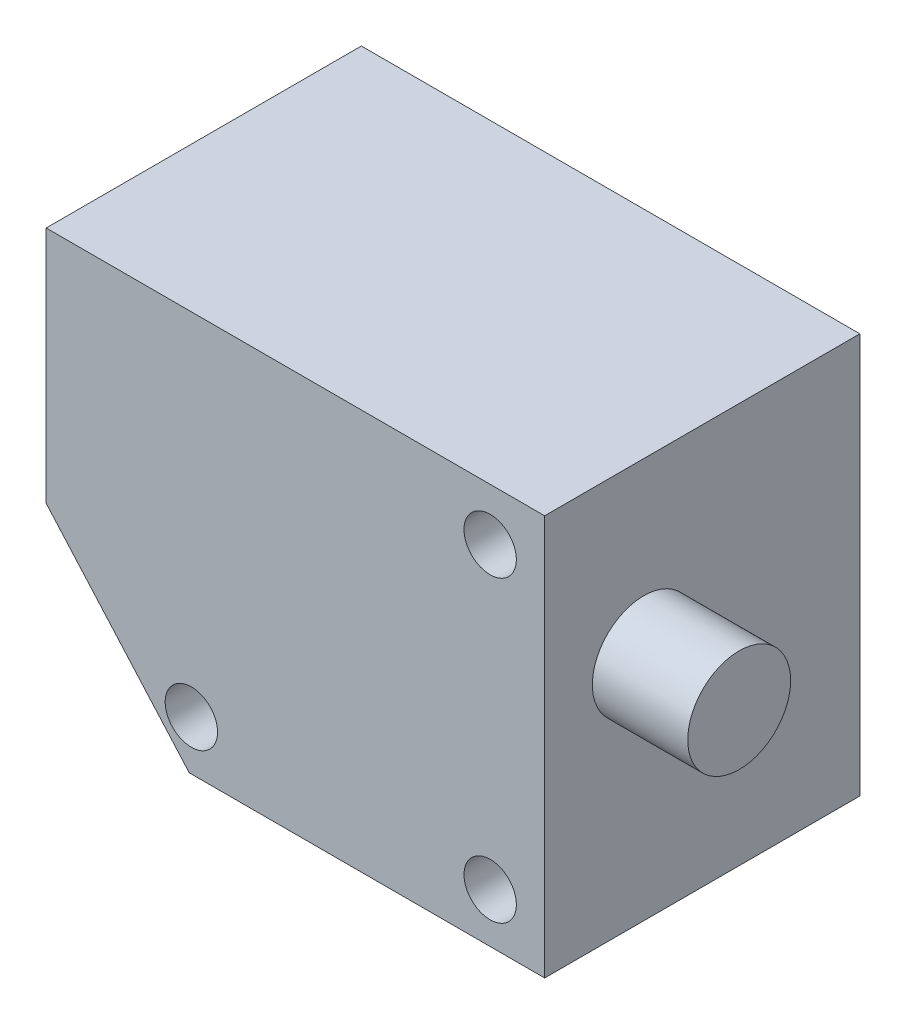
ISO-10303-21;
HEADER;
FILE_DESCRIPTION(('STEP AP214'),'2;1');
FILE_NAME('part.step','',(''),(''),'','','');
FILE_SCHEMA(('AUTOMOTIVE_DESIGN { 1 0 10303 214 1 1 1 1 }'));
ENDSEC;
DATA;
#1=APPLICATION_CONTEXT('core data for automotive mechanical design processes');
#2=APPLICATION_PROTOCOL_DEFINITION('international standard','automotive_design',2000,#1);
#3=PRODUCT_CONTEXT('',#1,'mechanical');
#4=PRODUCT('Part','Part','',(#3));
#5=PRODUCT_RELATED_PRODUCT_CATEGORY('part','',(#4));
#6=PRODUCT_DEFINITION_FORMATION('','',#4);
#7=PRODUCT_DEFINITION_CONTEXT('part definition',#1,'design');
#8=PRODUCT_DEFINITION('design','',#6,#7);
#9=PRODUCT_DEFINITION_SHAPE('','',#8);
#10=(LENGTH_UNIT() NAMED_UNIT(*) SI_UNIT(.MILLI.,.METRE.));
#11=(NAMED_UNIT(*) PLANE_ANGLE_UNIT() SI_UNIT($,.RADIAN.));
#12=(NAMED_UNIT(*) SI_UNIT($,.STERADIAN.) SOLID_ANGLE_UNIT());
#13=UNCERTAINTY_MEASURE_WITH_UNIT(LENGTH_MEASURE(1.E-05),#10,'distance_accuracy_value','');
#14=(GEOMETRIC_REPRESENTATION_CONTEXT(3) GLOBAL_UNCERTAINTY_ASSIGNED_CONTEXT((#13)) GLOBAL_UNIT_ASSIGNED_CONTEXT((#10,
#11,#12)) REPRESENTATION_CONTEXT('',''));
#15=CARTESIAN_POINT('',(0.,0.,0.));
#16=DIRECTION('',(0.,0.,1.));
#17=DIRECTION('',(1.,0.,0.));
#18=AXIS2_PLACEMENT_3D('',#15,#16,#17);
#19=CARTESIAN_POINT('',(26.65,21.4,16.85));
#20=DIRECTION('',(-1.,0.,0.));
#21=DIRECTION('',(0.,0.,1.));
#22=AXIS2_PLACEMENT_3D('',#19,#20,#21);
#23=PLANE('',#22);
#24=CARTESIAN_POINT('',(26.65,3.2,6.25));
#25=DIRECTION('',(1.,0.,0.));
#26=DIRECTION('',(0.,0.,-1.));
#27=AXIS2_PLACEMENT_3D('',#24,#25,#26);
#28=CIRCLE('',#27,5.5);
#29=CARTESIAN_POINT('',(26.65,3.2,0.750000000000001));
#30=VERTEX_POINT('',#29);
#31=EDGE_CURVE('E44',#30,#30,#28,.T.);
#32=ORIENTED_EDGE('',*,*,#31,.F.);
#33=EDGE_LOOP('',(#32));
#34=FACE_BOUND('',#33,.T.);
#35=DIRECTION('',(0.,0.,-1.));
#36=VECTOR('',#35,1.);
#37=CARTESIAN_POINT('',(26.65,-21.4,16.85));
#38=LINE('',#37,#36);
#39=CARTESIAN_POINT('',(26.65,-21.4,16.85));
#40=VERTEX_POINT('',#39);
#41=CARTESIAN_POINT('',(26.65,-21.4,-16.85));
#42=VERTEX_POINT('',#41);
#43=EDGE_CURVE('E98',#40,#42,#38,.T.);
#44=ORIENTED_EDGE('',*,*,#43,.T.);
#45=DIRECTION('',(0.,-1.,0.));
#46=VECTOR('',#45,1.);
#47=CARTESIAN_POINT('',(26.65,21.4,-16.85));
#48=LINE('',#47,#46);
#49=CARTESIAN_POINT('',(26.65,21.4,-16.85));
#50=VERTEX_POINT('',#49);
#51=EDGE_CURVE('E109',#50,#42,#48,.T.);
#52=ORIENTED_EDGE('',*,*,#51,.F.);
#53=DIRECTION('',(0.,0.,-1.));
#54=VECTOR('',#53,1.);
#55=CARTESIAN_POINT('',(26.65,21.4,16.85));
#56=LINE('',#55,#54);
#57=CARTESIAN_POINT('',(26.65,21.4,16.85));
#58=VERTEX_POINT('',#57);
#59=EDGE_CURVE('E117',#58,#50,#56,.T.);
#60=ORIENTED_EDGE('',*,*,#59,.F.);
#61=DIRECTION('',(0.,-1.,0.));
#62=VECTOR('',#61,1.);
#63=CARTESIAN_POINT('',(26.65,21.4,16.85));
#64=LINE('',#63,#62);
#65=EDGE_CURVE('E112',#58,#40,#64,.T.);
#66=ORIENTED_EDGE('',*,*,#65,.T.);
#67=EDGE_LOOP('',(#44,#52,#60,#66));
#68=FACE_BOUND('',#67,.T.);
#69=ADVANCED_FACE('F37',(#34,#68),#23,.F.);
#70=CARTESIAN_POINT('',(-26.65,21.4,-16.85));
#71=DIRECTION('',(0.,0.,1.));
#72=DIRECTION('',(1.,0.,0.));
#73=AXIS2_PLACEMENT_3D('',#70,#71,#72);
#74=PLANE('',#73);
#75=CARTESIAN_POINT('',(20.825,15.825,-16.85));
#76=DIRECTION('',(0.,0.,1.));
#77=DIRECTION('',(1.,0.,0.));
#78=AXIS2_PLACEMENT_3D('',#75,#76,#77);
#79=CIRCLE('',#78,1.44999999999999);
#80=CARTESIAN_POINT('',(22.275,15.825,-16.85));
#81=VERTEX_POINT('',#80);
#82=EDGE_CURVE('E159',#81,#81,#79,.T.);
#83=ORIENTED_EDGE('',*,*,#82,.T.);
#84=EDGE_LOOP('',(#83));
#85=FACE_BOUND('',#84,.T.);
#86=CARTESIAN_POINT('',(20.825,-16.125,-16.85));
#87=DIRECTION('',(0.,0.,1.));
#88=DIRECTION('',(1.,0.,0.));
#89=AXIS2_PLACEMENT_3D('',#86,#87,#88);
#90=CIRCLE('',#89,1.44999999999999);
#91=CARTESIAN_POINT('',(22.275,-16.125,-16.85));
#92=VERTEX_POINT('',#91);
#93=EDGE_CURVE('E147',#92,#92,#90,.T.);
#94=ORIENTED_EDGE('',*,*,#93,.T.);
#95=EDGE_LOOP('',(#94));
#96=FACE_BOUND('',#95,.T.);
#97=CARTESIAN_POINT('',(-11.125,-16.125,-16.85));
#98=DIRECTION('',(0.,0.,1.));
#99=DIRECTION('',(1.,0.,0.));
#100=AXIS2_PLACEMENT_3D('',#97,#98,#99);
#101=CIRCLE('',#100,1.44999999999999);
#102=CARTESIAN_POINT('',(-9.67499999999996,-16.125,-16.85));
#103=VERTEX_POINT('',#102);
#104=EDGE_CURVE('E135',#103,#103,#101,.T.);
#105=ORIENTED_EDGE('',*,*,#104,.T.);
#106=EDGE_LOOP('',(#105));
#107=FACE_BOUND('',#106,.T.);
#108=DIRECTION('',(-1.,0.,0.));
#109=VECTOR('',#108,1.);
#110=CARTESIAN_POINT('',(-26.65,-21.4,-16.85));
#111=LINE('',#110,#109);
#112=CARTESIAN_POINT('',(-11.35,-21.4,-16.85));
#113=VERTEX_POINT('',#112);
#114=EDGE_CURVE('E105',#42,#113,#111,.T.);
#115=ORIENTED_EDGE('',*,*,#114,.T.);
#116=DIRECTION('',(-0.662337662337662,0.749205459836673,0.));
#117=VECTOR('',#116,1.);
#118=CARTESIAN_POINT('',(-26.65,-4.09335387777285,-16.85));
#119=LINE('',#118,#117);
#120=CARTESIAN_POINT('',(-26.65,-4.09335387777285,-16.85));
#121=VERTEX_POINT('',#120);
#122=EDGE_CURVE('E51',#113,#121,#119,.T.);
#123=ORIENTED_EDGE('',*,*,#122,.T.);
#124=DIRECTION('',(0.,-1.,0.));
#125=VECTOR('',#124,1.);
#126=CARTESIAN_POINT('',(-26.65,21.4,-16.85));
#127=LINE('',#126,#125);
#128=CARTESIAN_POINT('',(-26.65,21.4,-16.85));
#129=VERTEX_POINT('',#128);
#130=EDGE_CURVE('E103',#129,#121,#127,.T.);
#131=ORIENTED_EDGE('',*,*,#130,.F.);
#132=DIRECTION('',(-1.,0.,0.));
#133=VECTOR('',#132,1.);
#134=CARTESIAN_POINT('',(-26.65,21.4,-16.85));
#135=LINE('',#134,#133);
#136=EDGE_CURVE('E83',#50,#129,#135,.T.);
#137=ORIENTED_EDGE('',*,*,#136,.F.);
#138=ORIENTED_EDGE('',*,*,#51,.T.);
#139=EDGE_LOOP('',(#115,#123,#131,#137,#138));
#140=FACE_BOUND('',#139,.T.);
#141=ADVANCED_FACE('F102',(#85,#96,#107,#140),#74,.F.);
#142=CARTESIAN_POINT('',(-26.65,21.4,16.85));
#143=DIRECTION('',(1.,0.,0.));
#144=DIRECTION('',(0.,0.,-1.));
#145=AXIS2_PLACEMENT_3D('',#142,#143,#144);
#146=PLANE('',#145);
#147=CARTESIAN_POINT('',(-26.65,3.2,6.25));
#148=DIRECTION('',(1.,0.,0.));
#149=DIRECTION('',(0.,0.,-1.));
#150=AXIS2_PLACEMENT_3D('',#147,#148,#149);
#151=CIRCLE('',#150,5.5);
#152=CARTESIAN_POINT('',(-26.65,3.2,0.750000000000001));
#153=VERTEX_POINT('',#152);
#154=EDGE_CURVE('E11',#153,#153,#151,.F.);
#155=ORIENTED_EDGE('',*,*,#154,.F.);
#156=EDGE_LOOP('',(#155));
#157=FACE_BOUND('',#156,.T.);
#158=ORIENTED_EDGE('',*,*,#130,.T.);
#159=DIRECTION('',(0.,0.,1.));
#160=VECTOR('',#159,1.);
#161=CARTESIAN_POINT('',(-26.65,-4.09335387777285,-16.85));
#162=LINE('',#161,#160);
#163=CARTESIAN_POINT('',(-26.65,-4.09335387777285,16.85));
#164=VERTEX_POINT('',#163);
#165=EDGE_CURVE('E91',#121,#164,#162,.T.);
#166=ORIENTED_EDGE('',*,*,#165,.T.);
#167=DIRECTION('',(0.,-1.,0.));
#168=VECTOR('',#167,1.);
#169=CARTESIAN_POINT('',(-26.65,21.4,16.85));
#170=LINE('',#169,#168);
#171=CARTESIAN_POINT('',(-26.65,21.4,16.85));
#172=VERTEX_POINT('',#171);
#173=EDGE_CURVE('E110',#172,#164,#170,.T.);
#174=ORIENTED_EDGE('',*,*,#173,.F.);
#175=DIRECTION('',(0.,0.,1.));
#176=VECTOR('',#175,1.);
#177=CARTESIAN_POINT('',(-26.65,21.4,16.85));
#178=LINE('',#177,#176);
#179=EDGE_CURVE('E108',#129,#172,#178,.T.);
#180=ORIENTED_EDGE('',*,*,#179,.F.);
#181=EDGE_LOOP('',(#158,#166,#174,#180));
#182=FACE_BOUND('',#181,.T.);
#183=ADVANCED_FACE('F107',(#157,#182),#146,.F.);
#184=CARTESIAN_POINT('',(-26.65,21.4,16.85));
#185=DIRECTION('',(0.,0.,-1.));
#186=DIRECTION('',(-1.,0.,0.));
#187=AXIS2_PLACEMENT_3D('',#184,#185,#186);
#188=PLANE('',#187);
#189=CARTESIAN_POINT('',(20.825,15.825,16.85));
#190=DIRECTION('',(0.,0.,1.));
#191=DIRECTION('',(1.,0.,0.));
#192=AXIS2_PLACEMENT_3D('',#189,#190,#191);
#193=CIRCLE('',#192,2.8);
#194=CARTESIAN_POINT('',(23.625,15.825,16.85));
#195=VERTEX_POINT('',#194);
#196=EDGE_CURVE('E168',#195,#195,#193,.T.);
#197=ORIENTED_EDGE('',*,*,#196,.F.);
#198=EDGE_LOOP('',(#197));
#199=FACE_BOUND('',#198,.T.);
#200=CARTESIAN_POINT('',(20.825,-16.125,16.85));
#201=DIRECTION('',(0.,0.,1.));
#202=DIRECTION('',(1.,0.,0.));
#203=AXIS2_PLACEMENT_3D('',#200,#201,#202);
#204=CIRCLE('',#203,2.8);
#205=CARTESIAN_POINT('',(23.625,-16.125,16.85));
#206=VERTEX_POINT('',#205);
#207=EDGE_CURVE('E156',#206,#206,#204,.T.);
#208=ORIENTED_EDGE('',*,*,#207,.F.);
#209=EDGE_LOOP('',(#208));
#210=FACE_BOUND('',#209,.T.);
#211=CARTESIAN_POINT('',(-11.125,-16.125,16.85));
#212=DIRECTION('',(0.,0.,1.));
#213=DIRECTION('',(1.,0.,0.));
#214=AXIS2_PLACEMENT_3D('',#211,#212,#213);
#215=CIRCLE('',#214,2.8);
#216=CARTESIAN_POINT('',(-8.32499999999995,-16.125,16.85));
#217=VERTEX_POINT('',#216);
#218=EDGE_CURVE('E144',#217,#217,#215,.T.);
#219=ORIENTED_EDGE('',*,*,#218,.F.);
#220=EDGE_LOOP('',(#219));
#221=FACE_BOUND('',#220,.T.);
#222=ORIENTED_EDGE('',*,*,#173,.T.);
#223=DIRECTION('',(-0.662337662337662,0.749205459836673,0.));
#224=VECTOR('',#223,1.);
#225=CARTESIAN_POINT('',(-26.65,-4.09335387777285,16.85));
#226=LINE('',#225,#224);
#227=CARTESIAN_POINT('',(-11.35,-21.4,16.85));
#228=VERTEX_POINT('',#227);
#229=EDGE_CURVE('E93',#228,#164,#226,.T.);
#230=ORIENTED_EDGE('',*,*,#229,.F.);
#231=DIRECTION('',(1.,0.,0.));
#232=VECTOR('',#231,1.);
#233=CARTESIAN_POINT('',(-26.65,-21.4,16.85));
#234=LINE('',#233,#232);
#235=EDGE_CURVE('E75',#228,#40,#234,.T.);
#236=ORIENTED_EDGE('',*,*,#235,.T.);
#237=ORIENTED_EDGE('',*,*,#65,.F.);
#238=DIRECTION('',(1.,0.,0.));
#239=VECTOR('',#238,1.);
#240=CARTESIAN_POINT('',(-26.65,21.4,16.85));
#241=LINE('',#240,#239);
#242=EDGE_CURVE('E60',#172,#58,#241,.T.);
#243=ORIENTED_EDGE('',*,*,#242,.F.);
#244=EDGE_LOOP('',(#222,#230,#236,#237,#243));
#245=FACE_BOUND('',#244,.T.);
#246=ADVANCED_FACE('F174',(#199,#210,#221,#245),#188,.F.);
#247=CARTESIAN_POINT('',(0.,21.4,0.));
#248=DIRECTION('',(0.,-1.,0.));
#249=DIRECTION('',(0.,0.,-1.));
#250=AXIS2_PLACEMENT_3D('',#247,#248,#249);
#251=PLANE('',#250);
#252=ORIENTED_EDGE('',*,*,#59,.T.);
#253=ORIENTED_EDGE('',*,*,#136,.T.);
#254=ORIENTED_EDGE('',*,*,#179,.T.);
#255=ORIENTED_EDGE('',*,*,#242,.T.);
#256=EDGE_LOOP('',(#252,#253,#254,#255));
#257=FACE_BOUND('',#256,.T.);
#258=ADVANCED_FACE('F177',(#257),#251,.F.);
#259=CARTESIAN_POINT('',(0.,-21.4,0.));
#260=DIRECTION('',(0.,-1.,0.));
#261=DIRECTION('',(0.,0.,-1.));
#262=AXIS2_PLACEMENT_3D('',#259,#260,#261);
#263=PLANE('',#262);
#264=DIRECTION('',(0.,0.,1.));
#265=VECTOR('',#264,1.);
#266=CARTESIAN_POINT('',(-11.35,-21.4,-16.85));
#267=LINE('',#266,#265);
#268=EDGE_CURVE('E99',#113,#228,#267,.T.);
#269=ORIENTED_EDGE('',*,*,#268,.F.);
#270=ORIENTED_EDGE('',*,*,#114,.F.);
#271=ORIENTED_EDGE('',*,*,#43,.F.);
#272=ORIENTED_EDGE('',*,*,#235,.F.);
#273=EDGE_LOOP('',(#269,#270,#271,#272));
#274=FACE_BOUND('',#273,.T.);
#275=ADVANCED_FACE('F187',(#274),#263,.T.);
#276=CARTESIAN_POINT('',(-26.65,-4.09335387777285,-16.85));
#277=DIRECTION('',(0.749205459836673,0.662337662337662,0.));
#278=DIRECTION('',(-0.662337662337662,0.749205459836673,0.));
#279=AXIS2_PLACEMENT_3D('',#276,#277,#278);
#280=PLANE('',#279);
#281=ORIENTED_EDGE('',*,*,#229,.T.);
#282=ORIENTED_EDGE('',*,*,#165,.F.);
#283=ORIENTED_EDGE('',*,*,#122,.F.);
#284=ORIENTED_EDGE('',*,*,#268,.T.);
#285=EDGE_LOOP('',(#281,#282,#283,#284));
#286=FACE_BOUND('',#285,.T.);
#287=ADVANCED_FACE('F92',(#286),#280,.F.);
#288=CARTESIAN_POINT('',(36.85,3.2,6.25));
#289=DIRECTION('',(-1.,0.,0.));
#290=DIRECTION('',(0.,0.,1.));
#291=AXIS2_PLACEMENT_3D('',#288,#289,#290);
#292=CYLINDRICAL_SURFACE('',#291,5.5);
#293=CARTESIAN_POINT('',(36.85,3.2,6.25));
#294=DIRECTION('',(1.,0.,0.));
#295=DIRECTION('',(0.,0.,-1.));
#296=AXIS2_PLACEMENT_3D('',#293,#294,#295);
#297=CIRCLE('',#296,5.5);
#298=CARTESIAN_POINT('',(36.85,3.2,0.750000000000001));
#299=VERTEX_POINT('',#298);
#300=EDGE_CURVE('E126',#299,#299,#297,.T.);
#301=ORIENTED_EDGE('',*,*,#300,.F.);
#302=EDGE_LOOP('',(#301));
#303=FACE_BOUND('',#302,.T.);
#304=ORIENTED_EDGE('',*,*,#31,.T.);
#305=EDGE_LOOP('',(#304));
#306=FACE_BOUND('',#305,.T.);
#307=ADVANCED_FACE('F203',(#303,#306),#292,.T.);
#308=CARTESIAN_POINT('',(36.85,3.2,6.25));
#309=DIRECTION('',(1.,0.,0.));
#310=DIRECTION('',(0.,0.,-1.));
#311=AXIS2_PLACEMENT_3D('',#308,#309,#310);
#312=PLANE('',#311);
#313=ORIENTED_EDGE('',*,*,#300,.T.);
#314=EDGE_LOOP('',(#313));
#315=FACE_BOUND('',#314,.T.);
#316=ADVANCED_FACE('F205',(#315),#312,.T.);
#317=CARTESIAN_POINT('',(-30.65,3.2,6.25));
#318=DIRECTION('',(1.,0.,0.));
#319=DIRECTION('',(0.,0.,-1.));
#320=AXIS2_PLACEMENT_3D('',#317,#318,#319);
#321=CYLINDRICAL_SURFACE('',#320,5.5);
#322=CARTESIAN_POINT('',(-30.65,3.2,6.25));
#323=DIRECTION('',(-1.,0.,0.));
#324=DIRECTION('',(0.,0.,1.));
#325=AXIS2_PLACEMENT_3D('',#322,#323,#324);
#326=CIRCLE('',#325,5.5);
#327=CARTESIAN_POINT('',(-30.65,3.2,11.75));
#328=VERTEX_POINT('',#327);
#329=EDGE_CURVE('E132',#328,#328,#326,.T.);
#330=ORIENTED_EDGE('',*,*,#329,.F.);
#331=EDGE_LOOP('',(#330));
#332=FACE_BOUND('',#331,.T.);
#333=ORIENTED_EDGE('',*,*,#154,.T.);
#334=EDGE_LOOP('',(#333));
#335=FACE_BOUND('',#334,.T.);
#336=ADVANCED_FACE('F212',(#332,#335),#321,.T.);
#337=CARTESIAN_POINT('',(-30.65,3.2,6.25));
#338=DIRECTION('',(-1.,0.,0.));
#339=DIRECTION('',(0.,0.,1.));
#340=AXIS2_PLACEMENT_3D('',#337,#338,#339);
#341=PLANE('',#340);
#342=ORIENTED_EDGE('',*,*,#329,.T.);
#343=EDGE_LOOP('',(#342));
#344=FACE_BOUND('',#343,.T.);
#345=ADVANCED_FACE('F219',(#344),#341,.T.);
#346=CARTESIAN_POINT('',(-11.125,-16.125,16.85));
#347=DIRECTION('',(0.,0.,1.));
#348=DIRECTION('',(1.,0.,0.));
#349=AXIS2_PLACEMENT_3D('',#346,#347,#348);
#350=CYLINDRICAL_SURFACE('',#349,1.45);
#351=ORIENTED_EDGE('',*,*,#104,.F.);
#352=EDGE_LOOP('',(#351));
#353=FACE_BOUND('',#352,.T.);
#354=CARTESIAN_POINT('',(-11.125,-16.125,12.46));
#355=DIRECTION('',(0.,0.,1.));
#356=DIRECTION('',(1.,0.,0.));
#357=AXIS2_PLACEMENT_3D('',#354,#355,#356);
#358=CIRCLE('',#357,1.45);
#359=CARTESIAN_POINT('',(-9.67499999999995,-16.125,12.46));
#360=VERTEX_POINT('',#359);
#361=EDGE_CURVE('E138',#360,#360,#358,.T.);
#362=ORIENTED_EDGE('',*,*,#361,.T.);
#363=EDGE_LOOP('',(#362));
#364=FACE_BOUND('',#363,.T.);
#365=ADVANCED_FACE('F223',(#353,#364),#350,.F.);
#366=CARTESIAN_POINT('',(-9.67499999999995,-16.125,12.46));
#367=DIRECTION('',(0.,0.,-1.));
#368=DIRECTION('',(-1.,0.,0.));
#369=AXIS2_PLACEMENT_3D('',#366,#367,#368);
#370=PLANE('',#369);
#371=ORIENTED_EDGE('',*,*,#361,.F.);
#372=EDGE_LOOP('',(#371));
#373=FACE_BOUND('',#372,.T.);
#374=CARTESIAN_POINT('',(-11.125,-16.125,12.46));
#375=DIRECTION('',(0.,0.,1.));
#376=DIRECTION('',(1.,0.,0.));
#377=AXIS2_PLACEMENT_3D('',#374,#375,#376);
#378=CIRCLE('',#377,2.8);
#379=CARTESIAN_POINT('',(-8.32499999999995,-16.125,12.46));
#380=VERTEX_POINT('',#379);
#381=EDGE_CURVE('E141',#380,#380,#378,.T.);
#382=ORIENTED_EDGE('',*,*,#381,.T.);
#383=EDGE_LOOP('',(#382));
#384=FACE_BOUND('',#383,.T.);
#385=ADVANCED_FACE('F227',(#373,#384),#370,.F.);
#386=CARTESIAN_POINT('',(-11.125,-16.125,16.85));
#387=DIRECTION('',(0.,0.,1.));
#388=DIRECTION('',(1.,0.,0.));
#389=AXIS2_PLACEMENT_3D('',#386,#387,#388);
#390=CYLINDRICAL_SURFACE('',#389,2.8);
#391=ORIENTED_EDGE('',*,*,#381,.F.);
#392=EDGE_LOOP('',(#391));
#393=FACE_BOUND('',#392,.T.);
#394=ORIENTED_EDGE('',*,*,#218,.T.);
#395=EDGE_LOOP('',(#394));
#396=FACE_BOUND('',#395,.T.);
#397=ADVANCED_FACE('F231',(#393,#396),#390,.F.);
#398=CARTESIAN_POINT('',(20.825,-16.125,16.85));
#399=DIRECTION('',(0.,0.,1.));
#400=DIRECTION('',(1.,0.,0.));
#401=AXIS2_PLACEMENT_3D('',#398,#399,#400);
#402=CYLINDRICAL_SURFACE('',#401,1.45);
#403=ORIENTED_EDGE('',*,*,#93,.F.);
#404=EDGE_LOOP('',(#403));
#405=FACE_BOUND('',#404,.T.);
#406=CARTESIAN_POINT('',(20.825,-16.125,12.46));
#407=DIRECTION('',(0.,0.,1.));
#408=DIRECTION('',(1.,0.,0.));
#409=AXIS2_PLACEMENT_3D('',#406,#407,#408);
#410=CIRCLE('',#409,1.45);
#411=CARTESIAN_POINT('',(22.2750000000001,-16.125,12.46));
#412=VERTEX_POINT('',#411);
#413=EDGE_CURVE('E150',#412,#412,#410,.T.);
#414=ORIENTED_EDGE('',*,*,#413,.T.);
#415=EDGE_LOOP('',(#414));
#416=FACE_BOUND('',#415,.T.);
#417=ADVANCED_FACE('F235',(#405,#416),#402,.F.);
#418=CARTESIAN_POINT('',(22.2750000000001,-16.125,12.46));
#419=DIRECTION('',(0.,0.,-1.));
#420=DIRECTION('',(-1.,0.,0.));
#421=AXIS2_PLACEMENT_3D('',#418,#419,#420);
#422=PLANE('',#421);
#423=ORIENTED_EDGE('',*,*,#413,.F.);
#424=EDGE_LOOP('',(#423));
#425=FACE_BOUND('',#424,.T.);
#426=CARTESIAN_POINT('',(20.825,-16.125,12.46));
#427=DIRECTION('',(0.,0.,1.));
#428=DIRECTION('',(1.,0.,0.));
#429=AXIS2_PLACEMENT_3D('',#426,#427,#428);
#430=CIRCLE('',#429,2.8);
#431=CARTESIAN_POINT('',(23.625,-16.125,12.46));
#432=VERTEX_POINT('',#431);
#433=EDGE_CURVE('E153',#432,#432,#430,.T.);
#434=ORIENTED_EDGE('',*,*,#433,.T.);
#435=EDGE_LOOP('',(#434));
#436=FACE_BOUND('',#435,.T.);
#437=ADVANCED_FACE('F239',(#425,#436),#422,.F.);
#438=CARTESIAN_POINT('',(20.825,-16.125,16.85));
#439=DIRECTION('',(0.,0.,1.));
#440=DIRECTION('',(1.,0.,0.));
#441=AXIS2_PLACEMENT_3D('',#438,#439,#440);
#442=CYLINDRICAL_SURFACE('',#441,2.8);
#443=ORIENTED_EDGE('',*,*,#433,.F.);
#444=EDGE_LOOP('',(#443));
#445=FACE_BOUND('',#444,.T.);
#446=ORIENTED_EDGE('',*,*,#207,.T.);
#447=EDGE_LOOP('',(#446));
#448=FACE_BOUND('',#447,.T.);
#449=ADVANCED_FACE('F243',(#445,#448),#442,.F.);
#450=CARTESIAN_POINT('',(20.825,15.825,16.85));
#451=DIRECTION('',(0.,0.,1.));
#452=DIRECTION('',(1.,0.,0.));
#453=AXIS2_PLACEMENT_3D('',#450,#451,#452);
#454=CYLINDRICAL_SURFACE('',#453,1.45);
#455=ORIENTED_EDGE('',*,*,#82,.F.);
#456=EDGE_LOOP('',(#455));
#457=FACE_BOUND('',#456,.T.);
#458=CARTESIAN_POINT('',(20.825,15.825,12.46));
#459=DIRECTION('',(0.,0.,1.));
#460=DIRECTION('',(1.,0.,0.));
#461=AXIS2_PLACEMENT_3D('',#458,#459,#460);
#462=CIRCLE('',#461,1.45);
#463=CARTESIAN_POINT('',(22.2750000000001,15.825,12.46));
#464=VERTEX_POINT('',#463);
#465=EDGE_CURVE('E162',#464,#464,#462,.T.);
#466=ORIENTED_EDGE('',*,*,#465,.T.);
#467=EDGE_LOOP('',(#466));
#468=FACE_BOUND('',#467,.T.);
#469=ADVANCED_FACE('F247',(#457,#468),#454,.F.);
#470=CARTESIAN_POINT('',(22.2750000000001,15.825,12.46));
#471=DIRECTION('',(0.,0.,-1.));
#472=DIRECTION('',(-1.,0.,0.));
#473=AXIS2_PLACEMENT_3D('',#470,#471,#472);
#474=PLANE('',#473);
#475=ORIENTED_EDGE('',*,*,#465,.F.);
#476=EDGE_LOOP('',(#475));
#477=FACE_BOUND('',#476,.T.);
#478=CARTESIAN_POINT('',(20.825,15.825,12.46));
#479=DIRECTION('',(0.,0.,1.));
#480=DIRECTION('',(1.,0.,0.));
#481=AXIS2_PLACEMENT_3D('',#478,#479,#480);
#482=CIRCLE('',#481,2.8);
#483=CARTESIAN_POINT('',(23.625,15.825,12.46));
#484=VERTEX_POINT('',#483);
#485=EDGE_CURVE('E165',#484,#484,#482,.T.);
#486=ORIENTED_EDGE('',*,*,#485,.T.);
#487=EDGE_LOOP('',(#486));
#488=FACE_BOUND('',#487,.T.);
#489=ADVANCED_FACE('F251',(#477,#488),#474,.F.);
#490=CARTESIAN_POINT('',(20.825,15.825,16.85));
#491=DIRECTION('',(0.,0.,1.));
#492=DIRECTION('',(1.,0.,0.));
#493=AXIS2_PLACEMENT_3D('',#490,#491,#492);
#494=CYLINDRICAL_SURFACE('',#493,2.8);
#495=ORIENTED_EDGE('',*,*,#485,.F.);
#496=EDGE_LOOP('',(#495));
#497=FACE_BOUND('',#496,.T.);
#498=ORIENTED_EDGE('',*,*,#196,.T.);
#499=EDGE_LOOP('',(#498));
#500=FACE_BOUND('',#499,.T.);
#501=ADVANCED_FACE('F172',(#497,#500),#494,.F.);
#502=CLOSED_SHELL('',(#69,#141,#183,#246,#258,#275,#287,#307,#316,#336,#345,#365,#385,#397,#417,
#437,#449,#469,#489,#501));
#503=MANIFOLD_SOLID_BREP('B2',#502);
#504=ADVANCED_BREP_SHAPE_REPRESENTATION('',(#18,#503),#14);
#505=SHAPE_DEFINITION_REPRESENTATION(#9,#504);
ENDSEC;
END-ISO-10303-21;
